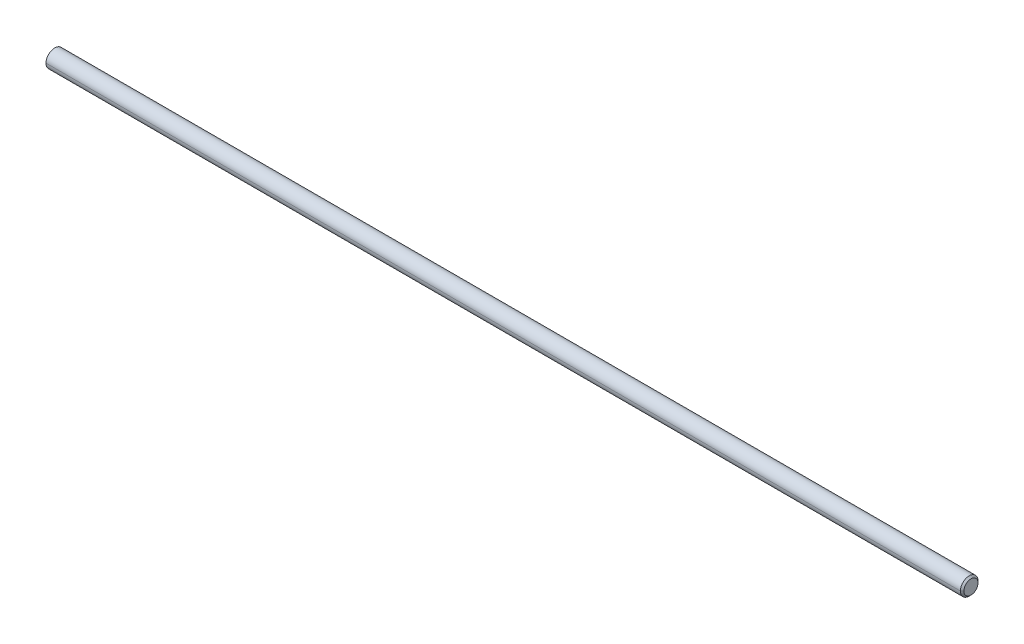
ISO-10303-21;
HEADER;
FILE_DESCRIPTION(('STEP AP214'),'2;1');
FILE_NAME('part.step','',(''),(''),'','','');
FILE_SCHEMA(('AUTOMOTIVE_DESIGN { 1 0 10303 214 1 1 1 1 }'));
ENDSEC;
DATA;
#1=APPLICATION_CONTEXT('core data for automotive mechanical design processes');
#2=APPLICATION_PROTOCOL_DEFINITION('international standard','automotive_design',2000,#1);
#3=PRODUCT_CONTEXT('',#1,'mechanical');
#4=PRODUCT('Part','Part','',(#3));
#5=PRODUCT_RELATED_PRODUCT_CATEGORY('part','',(#4));
#6=PRODUCT_DEFINITION_FORMATION('','',#4);
#7=PRODUCT_DEFINITION_CONTEXT('part definition',#1,'design');
#8=PRODUCT_DEFINITION('design','',#6,#7);
#9=PRODUCT_DEFINITION_SHAPE('','',#8);
#10=(LENGTH_UNIT() NAMED_UNIT(*) SI_UNIT(.MILLI.,.METRE.));
#11=(NAMED_UNIT(*) PLANE_ANGLE_UNIT() SI_UNIT($,.RADIAN.));
#12=(NAMED_UNIT(*) SI_UNIT($,.STERADIAN.) SOLID_ANGLE_UNIT());
#13=UNCERTAINTY_MEASURE_WITH_UNIT(LENGTH_MEASURE(1.E-05),#10,'distance_accuracy_value','');
#14=(GEOMETRIC_REPRESENTATION_CONTEXT(3) GLOBAL_UNCERTAINTY_ASSIGNED_CONTEXT((#13)) GLOBAL_UNIT_ASSIGNED_CONTEXT((#10,
#11,#12)) REPRESENTATION_CONTEXT('',''));
#15=CARTESIAN_POINT('',(0.,0.,0.));
#16=DIRECTION('',(0.,0.,1.));
#17=DIRECTION('',(1.,0.,0.));
#18=AXIS2_PLACEMENT_3D('',#15,#16,#17);
#19=CARTESIAN_POINT('',(152.4,0.,0.));
#20=DIRECTION('',(-1.,0.,0.));
#21=DIRECTION('',(0.,0.,1.));
#22=AXIS2_PLACEMENT_3D('',#19,#20,#21);
#23=CONICAL_SURFACE('',#22,1.27,0.785398163397418);
#24=DIRECTION('',(-0.707106781186569,0.,-0.707106781186526));
#25=VECTOR('',#24,1.);
#26=CARTESIAN_POINT('',(152.4,0.,-1.27));
#27=LINE('',#26,#25);
#28=CARTESIAN_POINT('',(152.4,0.,-1.27));
#29=VERTEX_POINT('',#28);
#30=CARTESIAN_POINT('',(152.0825,0.,-1.5875));
#31=VERTEX_POINT('',#30);
#32=EDGE_CURVE('E113',#29,#31,#27,.T.);
#33=ORIENTED_EDGE('',*,*,#32,.F.);
#34=CARTESIAN_POINT('',(152.4,0.,0.));
#35=DIRECTION('',(1.,0.,0.));
#36=DIRECTION('',(0.,0.,-1.));
#37=AXIS2_PLACEMENT_3D('',#34,#35,#36);
#38=CIRCLE('',#37,1.27);
#39=CARTESIAN_POINT('',(152.4,0.,1.27));
#40=VERTEX_POINT('',#39);
#41=EDGE_CURVE('E56',#40,#29,#38,.T.);
#42=ORIENTED_EDGE('',*,*,#41,.F.);
#43=DIRECTION('',(-0.707106781186569,0.,0.707106781186526));
#44=VECTOR('',#43,1.);
#45=CARTESIAN_POINT('',(152.4,0.,1.27));
#46=LINE('',#45,#44);
#47=CARTESIAN_POINT('',(152.0825,0.,1.5875));
#48=VERTEX_POINT('',#47);
#49=EDGE_CURVE('E101',#40,#48,#46,.T.);
#50=ORIENTED_EDGE('',*,*,#49,.T.);
#51=CARTESIAN_POINT('',(152.0825,0.,0.));
#52=DIRECTION('',(-1.,0.,0.));
#53=DIRECTION('',(0.,0.,-1.));
#54=AXIS2_PLACEMENT_3D('',#51,#52,#53);
#55=CIRCLE('',#54,1.5875);
#56=EDGE_CURVE('E98',#31,#48,#55,.T.);
#57=ORIENTED_EDGE('',*,*,#56,.F.);
#58=EDGE_LOOP('',(#33,#42,#50,#57));
#59=FACE_BOUND('',#58,.T.);
#60=ADVANCED_FACE('F49',(#59),#23,.T.);
#61=CARTESIAN_POINT('',(152.4,0.,0.));
#62=DIRECTION('',(1.,0.,0.));
#63=DIRECTION('',(0.,1.,0.));
#64=AXIS2_PLACEMENT_3D('',#61,#62,#63);
#65=PLANE('',#64);
#66=ORIENTED_EDGE('',*,*,#41,.T.);
#67=CARTESIAN_POINT('',(152.4,0.,0.));
#68=DIRECTION('',(1.,0.,0.));
#69=DIRECTION('',(0.,0.,-1.));
#70=AXIS2_PLACEMENT_3D('',#67,#68,#69);
#71=CIRCLE('',#70,1.27);
#72=EDGE_CURVE('E94',#29,#40,#71,.T.);
#73=ORIENTED_EDGE('',*,*,#72,.T.);
#74=EDGE_LOOP('',(#66,#73));
#75=FACE_BOUND('',#74,.T.);
#76=ADVANCED_FACE('F125',(#75),#65,.T.);
#77=CARTESIAN_POINT('',(-152.4,0.,0.));
#78=DIRECTION('',(1.,0.,0.));
#79=DIRECTION('',(0.,0.,-1.));
#80=AXIS2_PLACEMENT_3D('',#77,#78,#79);
#81=CYLINDRICAL_SURFACE('',#80,1.5875);
#82=CARTESIAN_POINT('',(-12.7,0.,0.));
#83=DIRECTION('',(1.,0.,0.));
#84=DIRECTION('',(0.,0.,-1.));
#85=AXIS2_PLACEMENT_3D('',#82,#83,#84);
#86=CIRCLE('',#85,1.5875);
#87=CARTESIAN_POINT('',(-12.7,0.,-1.5875));
#88=VERTEX_POINT('',#87);
#89=CARTESIAN_POINT('',(-12.7,0.,1.5875));
#90=VERTEX_POINT('',#89);
#91=EDGE_CURVE('E92',#88,#90,#86,.F.);
#92=ORIENTED_EDGE('',*,*,#91,.F.);
#93=DIRECTION('',(1.,0.,0.));
#94=VECTOR('',#93,1.);
#95=CARTESIAN_POINT('',(-152.4,0.,-1.5875));
#96=LINE('',#95,#94);
#97=EDGE_CURVE('E80',#88,#31,#96,.T.);
#98=ORIENTED_EDGE('',*,*,#97,.T.);
#99=ORIENTED_EDGE('',*,*,#56,.T.);
#100=DIRECTION('',(1.,0.,0.));
#101=VECTOR('',#100,1.);
#102=CARTESIAN_POINT('',(-152.4,0.,1.5875));
#103=LINE('',#102,#101);
#104=EDGE_CURVE('E68',#90,#48,#103,.T.);
#105=ORIENTED_EDGE('',*,*,#104,.F.);
#106=EDGE_LOOP('',(#92,#98,#99,#105));
#107=FACE_BOUND('',#106,.T.);
#108=ADVANCED_FACE('F97',(#107),#81,.T.);
#109=CARTESIAN_POINT('',(-152.4,0.,0.));
#110=DIRECTION('',(1.,0.,0.));
#111=DIRECTION('',(0.,0.,-1.));
#112=AXIS2_PLACEMENT_3D('',#109,#110,#111);
#113=CYLINDRICAL_SURFACE('',#112,1.5875);
#114=CARTESIAN_POINT('',(-12.7,0.,0.));
#115=DIRECTION('',(1.,0.,0.));
#116=DIRECTION('',(0.,0.,-1.));
#117=AXIS2_PLACEMENT_3D('',#114,#115,#116);
#118=CIRCLE('',#117,1.5875);
#119=EDGE_CURVE('E11',#90,#88,#118,.F.);
#120=ORIENTED_EDGE('',*,*,#119,.F.);
#121=ORIENTED_EDGE('',*,*,#104,.T.);
#122=CARTESIAN_POINT('',(152.0825,0.,0.));
#123=DIRECTION('',(-1.,0.,0.));
#124=DIRECTION('',(0.,0.,-1.));
#125=AXIS2_PLACEMENT_3D('',#122,#123,#124);
#126=CIRCLE('',#125,1.5875);
#127=EDGE_CURVE('E106',#48,#31,#126,.T.);
#128=ORIENTED_EDGE('',*,*,#127,.T.);
#129=ORIENTED_EDGE('',*,*,#97,.F.);
#130=EDGE_LOOP('',(#120,#121,#128,#129));
#131=FACE_BOUND('',#130,.T.);
#132=ADVANCED_FACE('F96',(#131),#113,.T.);
#133=CARTESIAN_POINT('',(152.4,0.,0.));
#134=DIRECTION('',(-1.,0.,0.));
#135=DIRECTION('',(0.,0.,1.));
#136=AXIS2_PLACEMENT_3D('',#133,#134,#135);
#137=CONICAL_SURFACE('',#136,1.27,0.785398163397418);
#138=ORIENTED_EDGE('',*,*,#72,.F.);
#139=ORIENTED_EDGE('',*,*,#32,.T.);
#140=ORIENTED_EDGE('',*,*,#127,.F.);
#141=ORIENTED_EDGE('',*,*,#49,.F.);
#142=EDGE_LOOP('',(#138,#139,#140,#141));
#143=FACE_BOUND('',#142,.T.);
#144=ADVANCED_FACE('F129',(#143),#137,.T.);
#145=CARTESIAN_POINT('',(-12.7,-1.5875,-1.5875));
#146=DIRECTION('',(1.,0.,0.));
#147=DIRECTION('',(0.,0.,-1.));
#148=AXIS2_PLACEMENT_3D('',#145,#146,#147);
#149=PLANE('',#148);
#150=ORIENTED_EDGE('',*,*,#91,.T.);
#151=ORIENTED_EDGE('',*,*,#119,.T.);
#152=EDGE_LOOP('',(#150,#151));
#153=FACE_BOUND('',#152,.T.);
#154=ADVANCED_FACE('F93',(#153),#149,.F.);
#155=CLOSED_SHELL('',(#60,#76,#108,#132,#144,#154));
#156=MANIFOLD_SOLID_BREP('B2',#155);
#157=ADVANCED_BREP_SHAPE_REPRESENTATION('',(#18,#156),#14);
#158=SHAPE_DEFINITION_REPRESENTATION(#9,#157);
ENDSEC;
END-ISO-10303-21;
